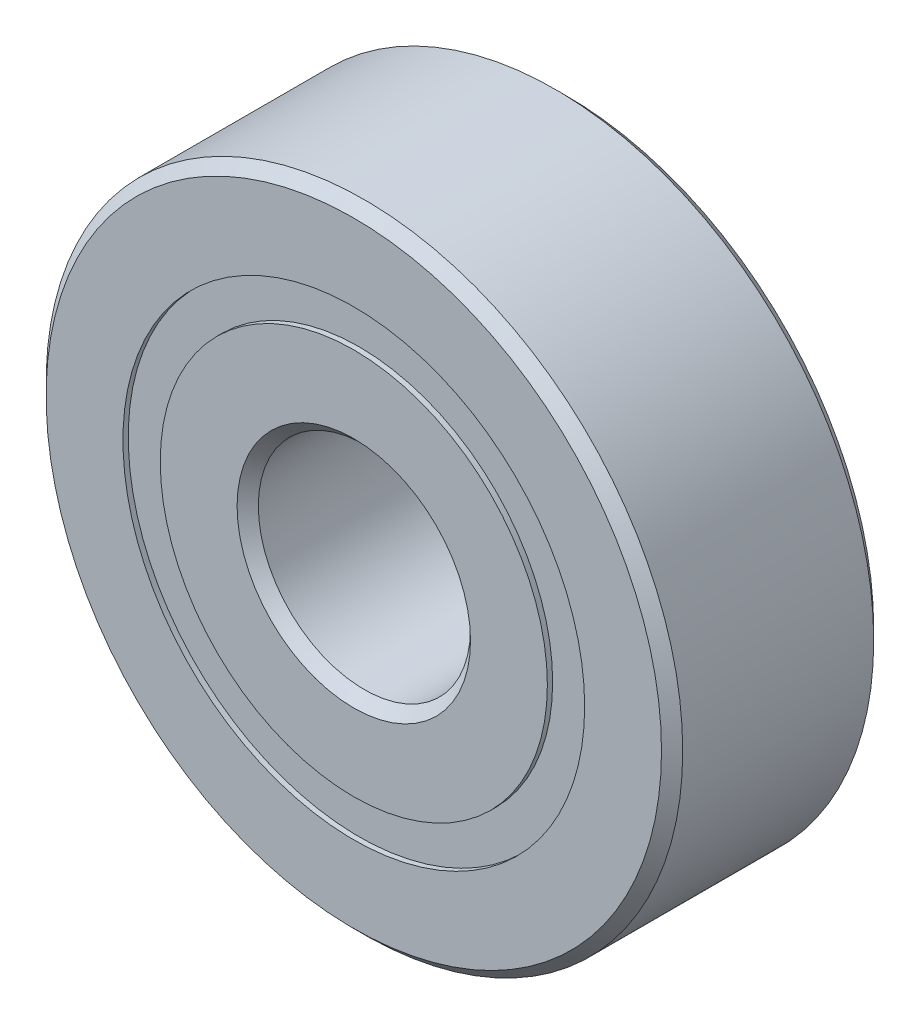
ISO-10303-21;
HEADER;
FILE_DESCRIPTION(('STEP AP214'),'2;1');
FILE_NAME('part.step','',(''),(''),'','','');
FILE_SCHEMA(('AUTOMOTIVE_DESIGN { 1 0 10303 214 1 1 1 1 }'));
ENDSEC;
DATA;
#1=APPLICATION_CONTEXT('core data for automotive mechanical design processes');
#2=APPLICATION_PROTOCOL_DEFINITION('international standard','automotive_design',2000,#1);
#3=PRODUCT_CONTEXT('',#1,'mechanical');
#4=PRODUCT('Part','Part','',(#3));
#5=PRODUCT_RELATED_PRODUCT_CATEGORY('part','',(#4));
#6=PRODUCT_DEFINITION_FORMATION('','',#4);
#7=PRODUCT_DEFINITION_CONTEXT('part definition',#1,'design');
#8=PRODUCT_DEFINITION('design','',#6,#7);
#9=PRODUCT_DEFINITION_SHAPE('','',#8);
#10=(LENGTH_UNIT() NAMED_UNIT(*) SI_UNIT(.MILLI.,.METRE.));
#11=(NAMED_UNIT(*) PLANE_ANGLE_UNIT() SI_UNIT($,.RADIAN.));
#12=(NAMED_UNIT(*) SI_UNIT($,.STERADIAN.) SOLID_ANGLE_UNIT());
#13=UNCERTAINTY_MEASURE_WITH_UNIT(LENGTH_MEASURE(1.E-05),#10,'distance_accuracy_value','');
#14=(GEOMETRIC_REPRESENTATION_CONTEXT(3) GLOBAL_UNCERTAINTY_ASSIGNED_CONTEXT((#13)) GLOBAL_UNIT_ASSIGNED_CONTEXT((#10,
#11,#12)) REPRESENTATION_CONTEXT('',''));
#15=CARTESIAN_POINT('',(0.,0.,0.));
#16=DIRECTION('',(0.,0.,1.));
#17=DIRECTION('',(1.,0.,0.));
#18=AXIS2_PLACEMENT_3D('',#15,#16,#17);
#19=CARTESIAN_POINT('',(0.,0.,1.8));
#20=DIRECTION('',(0.,0.,-0.999999999999999));
#21=DIRECTION('',(-1.,0.,0.));
#22=AXIS2_PLACEMENT_3D('',#19,#20,#21);
#23=CONICAL_SURFACE('',#22,6.,0.78539816339745);
#24=CARTESIAN_POINT('',(0.,0.,2.));
#25=DIRECTION('',(0.,0.,0.999999999999999));
#26=DIRECTION('',(1.,0.,0.));
#27=AXIS2_PLACEMENT_3D('',#24,#25,#26);
#28=CIRCLE('',#27,5.8);
#29=CARTESIAN_POINT('',(5.8,0.,2.));
#30=VERTEX_POINT('',#29);
#31=EDGE_CURVE('P0_E43',#30,#30,#28,.T.);
#32=ORIENTED_EDGE('',*,*,#31,.F.);
#33=EDGE_LOOP('',(#32));
#34=FACE_BOUND('',#33,.T.);
#35=CARTESIAN_POINT('',(0.,0.,1.8));
#36=DIRECTION('',(0.,0.,0.999999999999999));
#37=DIRECTION('',(1.,0.,0.));
#38=AXIS2_PLACEMENT_3D('',#35,#36,#37);
#39=CIRCLE('',#38,6.);
#40=CARTESIAN_POINT('',(6.,0.,1.8));
#41=VERTEX_POINT('',#40);
#42=EDGE_CURVE('P0_E10',#41,#41,#39,.T.);
#43=ORIENTED_EDGE('',*,*,#42,.T.);
#44=EDGE_LOOP('',(#43));
#45=FACE_BOUND('',#44,.T.);
#46=ADVANCED_FACE('P0_F15',(#34,#45),#23,.T.);
#47=CARTESIAN_POINT('',(0.,0.,2.));
#48=DIRECTION('',(0.,0.,0.999999999999999));
#49=DIRECTION('',(1.,0.,0.));
#50=AXIS2_PLACEMENT_3D('',#47,#48,#49);
#51=CYLINDRICAL_SURFACE('',#50,6.);
#52=ORIENTED_EDGE('',*,*,#42,.F.);
#53=EDGE_LOOP('',(#52));
#54=FACE_BOUND('',#53,.T.);
#55=CARTESIAN_POINT('',(0.,0.,-1.79999999999999));
#56=DIRECTION('',(0.,0.,0.999999999999999));
#57=DIRECTION('',(1.,0.,0.));
#58=AXIS2_PLACEMENT_3D('',#55,#56,#57);
#59=CIRCLE('',#58,6.);
#60=CARTESIAN_POINT('',(6.,0.,-1.79999999999999));
#61=VERTEX_POINT('',#60);
#62=EDGE_CURVE('P0_E21',#61,#61,#59,.T.);
#63=ORIENTED_EDGE('',*,*,#62,.T.);
#64=EDGE_LOOP('',(#63));
#65=FACE_BOUND('',#64,.T.);
#66=ADVANCED_FACE('P0_F50',(#54,#65),#51,.T.);
#67=CARTESIAN_POINT('',(0.,0.,-2.));
#68=DIRECTION('',(0.,0.,0.999999999999999));
#69=DIRECTION('',(1.,0.,0.));
#70=AXIS2_PLACEMENT_3D('',#67,#68,#69);
#71=CONICAL_SURFACE('',#70,5.8,0.78539816339745);
#72=ORIENTED_EDGE('',*,*,#62,.F.);
#73=EDGE_LOOP('',(#72));
#74=FACE_BOUND('',#73,.T.);
#75=CARTESIAN_POINT('',(0.,0.,-2.));
#76=DIRECTION('',(0.,0.,0.999999999999999));
#77=DIRECTION('',(1.,0.,0.));
#78=AXIS2_PLACEMENT_3D('',#75,#76,#77);
#79=CIRCLE('',#78,5.8);
#80=CARTESIAN_POINT('',(5.8,0.,-2.));
#81=VERTEX_POINT('',#80);
#82=EDGE_CURVE('P0_E25',#81,#81,#79,.T.);
#83=ORIENTED_EDGE('',*,*,#82,.T.);
#84=EDGE_LOOP('',(#83));
#85=FACE_BOUND('',#84,.T.);
#86=ADVANCED_FACE('P0_F55',(#74,#85),#71,.T.);
#87=CARTESIAN_POINT('',(0.,5.8,-2.));
#88=DIRECTION('',(0.,0.,0.999999999999999));
#89=DIRECTION('',(1.,0.,0.));
#90=AXIS2_PLACEMENT_3D('',#87,#88,#89);
#91=PLANE('',#90);
#92=ORIENTED_EDGE('',*,*,#82,.F.);
#93=EDGE_LOOP('',(#92));
#94=FACE_BOUND('',#93,.T.);
#95=CARTESIAN_POINT('',(0.,0.,-2.));
#96=DIRECTION('',(0.,0.,0.999999999999999));
#97=DIRECTION('',(1.,0.,0.));
#98=AXIS2_PLACEMENT_3D('',#95,#96,#97);
#99=CIRCLE('',#98,4.35164835164835);
#100=CARTESIAN_POINT('',(4.35164835164835,0.,-2.));
#101=VERTEX_POINT('',#100);
#102=EDGE_CURVE('P0_E29',#101,#101,#99,.T.);
#103=ORIENTED_EDGE('',*,*,#102,.T.);
#104=EDGE_LOOP('',(#103));
#105=FACE_BOUND('',#104,.T.);
#106=ADVANCED_FACE('P0_F60',(#94,#105),#91,.F.);
#107=CARTESIAN_POINT('',(0.,0.,2.));
#108=DIRECTION('',(0.,0.,0.999999999999999));
#109=DIRECTION('',(1.,0.,0.));
#110=AXIS2_PLACEMENT_3D('',#107,#108,#109);
#111=CYLINDRICAL_SURFACE('',#110,4.35164835164835);
#112=ORIENTED_EDGE('',*,*,#102,.F.);
#113=EDGE_LOOP('',(#112));
#114=FACE_BOUND('',#113,.T.);
#115=CARTESIAN_POINT('',(0.,0.,-0.888888888888884));
#116=DIRECTION('',(0.,0.,0.999999999999999));
#117=DIRECTION('',(1.,0.,0.));
#118=AXIS2_PLACEMENT_3D('',#115,#116,#117);
#119=CIRCLE('',#118,4.35164835164835);
#120=CARTESIAN_POINT('',(4.35164835164835,0.,-0.888888888888884));
#121=VERTEX_POINT('',#120);
#122=EDGE_CURVE('P0_E34',#121,#121,#119,.T.);
#123=ORIENTED_EDGE('',*,*,#122,.T.);
#124=EDGE_LOOP('',(#123));
#125=FACE_BOUND('',#124,.T.);
#126=ADVANCED_FACE('P0_F66',(#114,#125),#111,.F.);
#127=CARTESIAN_POINT('',(0.,0.,0.));
#128=DIRECTION('',(0.,0.,0.999999999999999));
#129=DIRECTION('',(1.,0.,0.));
#130=AXIS2_PLACEMENT_3D('',#127,#128,#129);
#131=TOROIDAL_SURFACE('',#130,4.,0.955918417024761);
#132=ORIENTED_EDGE('',*,*,#122,.F.);
#133=EDGE_LOOP('',(#132));
#134=FACE_BOUND('',#133,.T.);
#135=CARTESIAN_POINT('',(0.,0.,0.888888888888884));
#136=DIRECTION('',(0.,0.,0.999999999999999));
#137=DIRECTION('',(1.,0.,0.));
#138=AXIS2_PLACEMENT_3D('',#135,#136,#137);
#139=CIRCLE('',#138,4.35164835164835);
#140=CARTESIAN_POINT('',(4.35164835164835,0.,0.888888888888884));
#141=VERTEX_POINT('',#140);
#142=EDGE_CURVE('P0_E37',#141,#141,#139,.T.);
#143=ORIENTED_EDGE('',*,*,#142,.T.);
#144=EDGE_LOOP('',(#143));
#145=FACE_BOUND('',#144,.T.);
#146=ADVANCED_FACE('P0_F70',(#134,#145),#131,.F.);
#147=CARTESIAN_POINT('',(0.,0.,2.));
#148=DIRECTION('',(0.,0.,0.999999999999999));
#149=DIRECTION('',(1.,0.,0.));
#150=AXIS2_PLACEMENT_3D('',#147,#148,#149);
#151=CYLINDRICAL_SURFACE('',#150,4.35164835164835);
#152=ORIENTED_EDGE('',*,*,#142,.F.);
#153=EDGE_LOOP('',(#152));
#154=FACE_BOUND('',#153,.T.);
#155=CARTESIAN_POINT('',(0.,0.,2.));
#156=DIRECTION('',(0.,0.,0.999999999999999));
#157=DIRECTION('',(1.,0.,0.));
#158=AXIS2_PLACEMENT_3D('',#155,#156,#157);
#159=CIRCLE('',#158,4.35164835164835);
#160=CARTESIAN_POINT('',(4.35164835164835,0.,2.));
#161=VERTEX_POINT('',#160);
#162=EDGE_CURVE('P0_E40',#161,#161,#159,.T.);
#163=ORIENTED_EDGE('',*,*,#162,.T.);
#164=EDGE_LOOP('',(#163));
#165=FACE_BOUND('',#164,.T.);
#166=ADVANCED_FACE('P0_F74',(#154,#165),#151,.F.);
#167=CARTESIAN_POINT('',(0.,5.8,2.));
#168=DIRECTION('',(0.,0.,-0.999999999999999));
#169=DIRECTION('',(-1.,0.,0.));
#170=AXIS2_PLACEMENT_3D('',#167,#168,#169);
#171=PLANE('',#170);
#172=ORIENTED_EDGE('',*,*,#162,.F.);
#173=EDGE_LOOP('',(#172));
#174=FACE_BOUND('',#173,.T.);
#175=ORIENTED_EDGE('',*,*,#31,.T.);
#176=EDGE_LOOP('',(#175));
#177=FACE_BOUND('',#176,.T.);
#178=ADVANCED_FACE('P0_F47',(#174,#177),#171,.F.);
#179=CLOSED_SHELL('',(#46,#66,#86,#106,#126,#146,#166,#178));
#180=MANIFOLD_SOLID_BREP('P0_B1',#179);
#181=CARTESIAN_POINT('',(-2.00000000000003,-3.46410161513774,0.));
#182=DIRECTION('',(0.,0.,0.999999999999999));
#183=DIRECTION('',(-0.500000000000007,-0.866025403784435,0.));
#184=AXIS2_PLACEMENT_3D('',#181,#182,#183);
#185=SPHERICAL_SURFACE('',#184,0.955918417024761);
#186=CARTESIAN_POINT('',(-2.00000000000003,-3.46410161513774,0.955918417024761));
#187=VERTEX_POINT('',#186);
#188=VERTEX_LOOP('',#187);
#189=FACE_BOUND('',#188,.T.);
#190=ADVANCED_FACE('P1_F13',(#189),#185,.T.);
#191=CLOSED_SHELL('',(#190));
#192=MANIFOLD_SOLID_BREP('P1_B1',#191);
#193=CARTESIAN_POINT('',(-3.46410161513777,-1.99999999999997,0.));
#194=DIRECTION('',(0.,0.,0.999999999999999));
#195=DIRECTION('',(-0.866025403784444,-0.499999999999992,0.));
#196=AXIS2_PLACEMENT_3D('',#193,#194,#195);
#197=SPHERICAL_SURFACE('',#196,0.955918417024761);
#198=CARTESIAN_POINT('',(-3.46410161513777,-1.99999999999997,0.955918417024761));
#199=VERTEX_POINT('',#198);
#200=VERTEX_LOOP('',#199);
#201=FACE_BOUND('',#200,.T.);
#202=ADVANCED_FACE('P2_F13',(#201),#197,.T.);
#203=CLOSED_SHELL('',(#202));
#204=MANIFOLD_SOLID_BREP('P2_B1',#203);
#205=CARTESIAN_POINT('',(-4.,0.,0.));
#206=DIRECTION('',(0.,0.,0.999999999999999));
#207=DIRECTION('',(-1.,0.,0.));
#208=AXIS2_PLACEMENT_3D('',#205,#206,#207);
#209=SPHERICAL_SURFACE('',#208,0.955918417024761);
#210=CARTESIAN_POINT('',(-4.,0.,0.955918417024761));
#211=VERTEX_POINT('',#210);
#212=VERTEX_LOOP('',#211);
#213=FACE_BOUND('',#212,.T.);
#214=ADVANCED_FACE('P3_F13',(#213),#209,.T.);
#215=CLOSED_SHELL('',(#214));
#216=MANIFOLD_SOLID_BREP('P3_B1',#215);
#217=CARTESIAN_POINT('',(-3.46410161513773,2.00000000000004,0.));
#218=DIRECTION('',(0.,0.,0.999999999999999));
#219=DIRECTION('',(-0.866025403784433,0.50000000000001,0.));
#220=AXIS2_PLACEMENT_3D('',#217,#218,#219);
#221=SPHERICAL_SURFACE('',#220,0.955918417024761);
#222=CARTESIAN_POINT('',(-3.46410161513773,2.00000000000004,0.955918417024761));
#223=VERTEX_POINT('',#222);
#224=VERTEX_LOOP('',#223);
#225=FACE_BOUND('',#224,.T.);
#226=ADVANCED_FACE('P4_F13',(#225),#221,.T.);
#227=CLOSED_SHELL('',(#226));
#228=MANIFOLD_SOLID_BREP('P4_B1',#227);
#229=CARTESIAN_POINT('',(-1.99999999999996,3.46410161513778,0.));
#230=DIRECTION('',(0.,0.,0.999999999999999));
#231=DIRECTION('',(-0.499999999999989,0.866025403784445,0.));
#232=AXIS2_PLACEMENT_3D('',#229,#230,#231);
#233=SPHERICAL_SURFACE('',#232,0.955918417024761);
#234=CARTESIAN_POINT('',(-1.99999999999996,3.46410161513778,0.955918417024761));
#235=VERTEX_POINT('',#234);
#236=VERTEX_LOOP('',#235);
#237=FACE_BOUND('',#236,.T.);
#238=ADVANCED_FACE('P5_F13',(#237),#233,.T.);
#239=CLOSED_SHELL('',(#238));
#240=MANIFOLD_SOLID_BREP('P5_B1',#239);
#241=CARTESIAN_POINT('',(0.,4.35164835164835,1.9));
#242=DIRECTION('',(0.,0.,-0.999999999999999));
#243=DIRECTION('',(-1.,0.,0.));
#244=AXIS2_PLACEMENT_3D('',#241,#242,#243);
#245=PLANE('',#244);
#246=CARTESIAN_POINT('',(0.,0.,1.9));
#247=DIRECTION('',(0.,0.,0.999999999999999));
#248=DIRECTION('',(1.,0.,0.));
#249=AXIS2_PLACEMENT_3D('',#246,#247,#248);
#250=CIRCLE('',#249,3.64835164835165);
#251=CARTESIAN_POINT('',(3.64835164835165,0.,1.9));
#252=VERTEX_POINT('',#251);
#253=EDGE_CURVE('P6_E10',#252,#252,#250,.T.);
#254=ORIENTED_EDGE('',*,*,#253,.F.);
#255=EDGE_LOOP('',(#254));
#256=FACE_BOUND('',#255,.T.);
#257=CARTESIAN_POINT('',(0.,0.,1.9));
#258=DIRECTION('',(0.,0.,0.999999999999999));
#259=DIRECTION('',(1.,0.,0.));
#260=AXIS2_PLACEMENT_3D('',#257,#258,#259);
#261=CIRCLE('',#260,4.35164835164835);
#262=CARTESIAN_POINT('',(4.35164835164835,0.,1.9));
#263=VERTEX_POINT('',#262);
#264=EDGE_CURVE('P6_E29',#263,#263,#261,.T.);
#265=ORIENTED_EDGE('',*,*,#264,.T.);
#266=EDGE_LOOP('',(#265));
#267=FACE_BOUND('',#266,.T.);
#268=ADVANCED_FACE('P6_F15',(#256,#267),#245,.F.);
#269=CARTESIAN_POINT('',(0.,0.,2.));
#270=DIRECTION('',(0.,0.,0.999999999999999));
#271=DIRECTION('',(1.,0.,0.));
#272=AXIS2_PLACEMENT_3D('',#269,#270,#271);
#273=CYLINDRICAL_SURFACE('',#272,3.64835164835165);
#274=CARTESIAN_POINT('',(0.,0.,0.955918417024762));
#275=DIRECTION('',(0.,0.,0.999999999999999));
#276=DIRECTION('',(1.,0.,0.));
#277=AXIS2_PLACEMENT_3D('',#274,#275,#276);
#278=CIRCLE('',#277,3.64835164835165);
#279=CARTESIAN_POINT('',(3.64835164835165,0.,0.955918417024762));
#280=VERTEX_POINT('',#279);
#281=EDGE_CURVE('P6_E21',#280,#280,#278,.T.);
#282=ORIENTED_EDGE('',*,*,#281,.F.);
#283=EDGE_LOOP('',(#282));
#284=FACE_BOUND('',#283,.T.);
#285=ORIENTED_EDGE('',*,*,#253,.T.);
#286=EDGE_LOOP('',(#285));
#287=FACE_BOUND('',#286,.T.);
#288=ADVANCED_FACE('P6_F44',(#284,#287),#273,.F.);
#289=CARTESIAN_POINT('',(0.,4.35164835164835,0.955918417024762));
#290=DIRECTION('',(0.,0.,0.999999999999999));
#291=DIRECTION('',(1.,0.,0.));
#292=AXIS2_PLACEMENT_3D('',#289,#290,#291);
#293=PLANE('',#292);
#294=CARTESIAN_POINT('',(0.,0.,0.955918417024762));
#295=DIRECTION('',(0.,0.,0.999999999999999));
#296=DIRECTION('',(1.,0.,0.));
#297=AXIS2_PLACEMENT_3D('',#294,#295,#296);
#298=CIRCLE('',#297,4.35164835164835);
#299=CARTESIAN_POINT('',(4.35164835164835,0.,0.955918417024762));
#300=VERTEX_POINT('',#299);
#301=EDGE_CURVE('P6_E25',#300,#300,#298,.T.);
#302=ORIENTED_EDGE('',*,*,#301,.F.);
#303=EDGE_LOOP('',(#302));
#304=FACE_BOUND('',#303,.T.);
#305=ORIENTED_EDGE('',*,*,#281,.T.);
#306=EDGE_LOOP('',(#305));
#307=FACE_BOUND('',#306,.T.);
#308=ADVANCED_FACE('P6_F39',(#304,#307),#293,.F.);
#309=CARTESIAN_POINT('',(0.,0.,2.));
#310=DIRECTION('',(0.,0.,0.999999999999999));
#311=DIRECTION('',(1.,0.,0.));
#312=AXIS2_PLACEMENT_3D('',#309,#310,#311);
#313=CYLINDRICAL_SURFACE('',#312,4.35164835164835);
#314=ORIENTED_EDGE('',*,*,#264,.F.);
#315=EDGE_LOOP('',(#314));
#316=FACE_BOUND('',#315,.T.);
#317=ORIENTED_EDGE('',*,*,#301,.T.);
#318=EDGE_LOOP('',(#317));
#319=FACE_BOUND('',#318,.T.);
#320=ADVANCED_FACE('P6_F36',(#316,#319),#313,.T.);
#321=CLOSED_SHELL('',(#268,#288,#308,#320));
#322=MANIFOLD_SOLID_BREP('P6_B1',#321);
#323=CARTESIAN_POINT('',(0.,4.35164835164835,-1.9));
#324=DIRECTION('',(0.,0.,0.999999999999999));
#325=DIRECTION('',(1.,0.,0.));
#326=AXIS2_PLACEMENT_3D('',#323,#324,#325);
#327=PLANE('',#326);
#328=CARTESIAN_POINT('',(0.,0.,-1.9));
#329=DIRECTION('',(0.,0.,0.999999999999999));
#330=DIRECTION('',(1.,0.,0.));
#331=AXIS2_PLACEMENT_3D('',#328,#329,#330);
#332=CIRCLE('',#331,4.35164835164835);
#333=CARTESIAN_POINT('',(4.35164835164835,0.,-1.9));
#334=VERTEX_POINT('',#333);
#335=EDGE_CURVE('P7_E29',#334,#334,#332,.T.);
#336=ORIENTED_EDGE('',*,*,#335,.F.);
#337=EDGE_LOOP('',(#336));
#338=FACE_BOUND('',#337,.T.);
#339=CARTESIAN_POINT('',(0.,0.,-1.9));
#340=DIRECTION('',(0.,0.,0.999999999999999));
#341=DIRECTION('',(1.,0.,0.));
#342=AXIS2_PLACEMENT_3D('',#339,#340,#341);
#343=CIRCLE('',#342,3.64835164835165);
#344=CARTESIAN_POINT('',(3.64835164835165,0.,-1.9));
#345=VERTEX_POINT('',#344);
#346=EDGE_CURVE('P7_E10',#345,#345,#343,.T.);
#347=ORIENTED_EDGE('',*,*,#346,.T.);
#348=EDGE_LOOP('',(#347));
#349=FACE_BOUND('',#348,.T.);
#350=ADVANCED_FACE('P7_F15',(#338,#349),#327,.F.);
#351=CARTESIAN_POINT('',(0.,0.,2.));
#352=DIRECTION('',(0.,0.,0.999999999999999));
#353=DIRECTION('',(1.,0.,0.));
#354=AXIS2_PLACEMENT_3D('',#351,#352,#353);
#355=CYLINDRICAL_SURFACE('',#354,3.64835164835165);
#356=ORIENTED_EDGE('',*,*,#346,.F.);
#357=EDGE_LOOP('',(#356));
#358=FACE_BOUND('',#357,.T.);
#359=CARTESIAN_POINT('',(0.,0.,-0.95591841702476));
#360=DIRECTION('',(0.,0.,0.999999999999999));
#361=DIRECTION('',(1.,0.,0.));
#362=AXIS2_PLACEMENT_3D('',#359,#360,#361);
#363=CIRCLE('',#362,3.64835164835165);
#364=CARTESIAN_POINT('',(3.64835164835165,0.,-0.95591841702476));
#365=VERTEX_POINT('',#364);
#366=EDGE_CURVE('P7_E21',#365,#365,#363,.T.);
#367=ORIENTED_EDGE('',*,*,#366,.T.);
#368=EDGE_LOOP('',(#367));
#369=FACE_BOUND('',#368,.T.);
#370=ADVANCED_FACE('P7_F38',(#358,#369),#355,.F.);
#371=CARTESIAN_POINT('',(0.,4.35164835164835,-0.95591841702476));
#372=DIRECTION('',(0.,0.,-0.999999999999999));
#373=DIRECTION('',(-1.,0.,0.));
#374=AXIS2_PLACEMENT_3D('',#371,#372,#373);
#375=PLANE('',#374);
#376=ORIENTED_EDGE('',*,*,#366,.F.);
#377=EDGE_LOOP('',(#376));
#378=FACE_BOUND('',#377,.T.);
#379=CARTESIAN_POINT('',(0.,0.,-0.95591841702476));
#380=DIRECTION('',(0.,0.,0.999999999999999));
#381=DIRECTION('',(1.,0.,0.));
#382=AXIS2_PLACEMENT_3D('',#379,#380,#381);
#383=CIRCLE('',#382,4.35164835164835);
#384=CARTESIAN_POINT('',(4.35164835164835,0.,-0.95591841702476));
#385=VERTEX_POINT('',#384);
#386=EDGE_CURVE('P7_E25',#385,#385,#383,.T.);
#387=ORIENTED_EDGE('',*,*,#386,.T.);
#388=EDGE_LOOP('',(#387));
#389=FACE_BOUND('',#388,.T.);
#390=ADVANCED_FACE('P7_F43',(#378,#389),#375,.F.);
#391=CARTESIAN_POINT('',(0.,0.,2.));
#392=DIRECTION('',(0.,0.,0.999999999999999));
#393=DIRECTION('',(1.,0.,0.));
#394=AXIS2_PLACEMENT_3D('',#391,#392,#393);
#395=CYLINDRICAL_SURFACE('',#394,4.35164835164835);
#396=ORIENTED_EDGE('',*,*,#386,.F.);
#397=EDGE_LOOP('',(#396));
#398=FACE_BOUND('',#397,.T.);
#399=ORIENTED_EDGE('',*,*,#335,.T.);
#400=EDGE_LOOP('',(#399));
#401=FACE_BOUND('',#400,.T.);
#402=ADVANCED_FACE('P7_F35',(#398,#401),#395,.T.);
#403=CLOSED_SHELL('',(#350,#370,#390,#402));
#404=MANIFOLD_SOLID_BREP('P7_B1',#403);
#405=CARTESIAN_POINT('',(0.,3.64835164835165,2.));
#406=DIRECTION('',(0.,0.,-0.999999999999999));
#407=DIRECTION('',(-1.,0.,0.));
#408=AXIS2_PLACEMENT_3D('',#405,#406,#407);
#409=PLANE('',#408);
#410=CARTESIAN_POINT('',(0.,0.,2.));
#411=DIRECTION('',(0.,0.,0.999999999999999));
#412=DIRECTION('',(1.,0.,0.));
#413=AXIS2_PLACEMENT_3D('',#410,#411,#412);
#414=CIRCLE('',#413,2.2);
#415=CARTESIAN_POINT('',(2.2,0.,2.));
#416=VERTEX_POINT('',#415);
#417=EDGE_CURVE('P8_E43',#416,#416,#414,.T.);
#418=ORIENTED_EDGE('',*,*,#417,.F.);
#419=EDGE_LOOP('',(#418));
#420=FACE_BOUND('',#419,.T.);
#421=CARTESIAN_POINT('',(0.,0.,2.));
#422=DIRECTION('',(0.,0.,0.999999999999999));
#423=DIRECTION('',(1.,0.,0.));
#424=AXIS2_PLACEMENT_3D('',#421,#422,#423);
#425=CIRCLE('',#424,3.64835164835165);
#426=CARTESIAN_POINT('',(3.64835164835165,0.,2.));
#427=VERTEX_POINT('',#426);
#428=EDGE_CURVE('P8_E10',#427,#427,#425,.T.);
#429=ORIENTED_EDGE('',*,*,#428,.T.);
#430=EDGE_LOOP('',(#429));
#431=FACE_BOUND('',#430,.T.);
#432=ADVANCED_FACE('P8_F15',(#420,#431),#409,.F.);
#433=CARTESIAN_POINT('',(0.,0.,2.));
#434=DIRECTION('',(0.,0.,0.999999999999999));
#435=DIRECTION('',(1.,0.,0.));
#436=AXIS2_PLACEMENT_3D('',#433,#434,#435);
#437=CYLINDRICAL_SURFACE('',#436,3.64835164835165);
#438=ORIENTED_EDGE('',*,*,#428,.F.);
#439=EDGE_LOOP('',(#438));
#440=FACE_BOUND('',#439,.T.);
#441=CARTESIAN_POINT('',(0.,0.,0.888888888888884));
#442=DIRECTION('',(0.,0.,0.999999999999999));
#443=DIRECTION('',(1.,0.,0.));
#444=AXIS2_PLACEMENT_3D('',#441,#442,#443);
#445=CIRCLE('',#444,3.64835164835165);
#446=CARTESIAN_POINT('',(3.64835164835165,0.,0.888888888888884));
#447=VERTEX_POINT('',#446);
#448=EDGE_CURVE('P8_E21',#447,#447,#445,.T.);
#449=ORIENTED_EDGE('',*,*,#448,.T.);
#450=EDGE_LOOP('',(#449));
#451=FACE_BOUND('',#450,.T.);
#452=ADVANCED_FACE('P8_F50',(#440,#451),#437,.T.);
#453=CARTESIAN_POINT('',(0.,0.,0.));
#454=DIRECTION('',(0.,0.,0.999999999999999));
#455=DIRECTION('',(1.,0.,0.));
#456=AXIS2_PLACEMENT_3D('',#453,#454,#455);
#457=TOROIDAL_SURFACE('',#456,4.,0.95591841702476);
#458=ORIENTED_EDGE('',*,*,#448,.F.);
#459=EDGE_LOOP('',(#458));
#460=FACE_BOUND('',#459,.T.);
#461=CARTESIAN_POINT('',(0.,0.,-0.888888888888884));
#462=DIRECTION('',(0.,0.,0.999999999999999));
#463=DIRECTION('',(1.,0.,0.));
#464=AXIS2_PLACEMENT_3D('',#461,#462,#463);
#465=CIRCLE('',#464,3.64835164835165);
#466=CARTESIAN_POINT('',(3.64835164835165,0.,-0.888888888888884));
#467=VERTEX_POINT('',#466);
#468=EDGE_CURVE('P8_E25',#467,#467,#465,.T.);
#469=ORIENTED_EDGE('',*,*,#468,.T.);
#470=EDGE_LOOP('',(#469));
#471=FACE_BOUND('',#470,.T.);
#472=ADVANCED_FACE('P8_F55',(#460,#471),#457,.F.);
#473=CARTESIAN_POINT('',(0.,0.,2.));
#474=DIRECTION('',(0.,0.,0.999999999999999));
#475=DIRECTION('',(1.,0.,0.));
#476=AXIS2_PLACEMENT_3D('',#473,#474,#475);
#477=CYLINDRICAL_SURFACE('',#476,3.64835164835165);
#478=ORIENTED_EDGE('',*,*,#468,.F.);
#479=EDGE_LOOP('',(#478));
#480=FACE_BOUND('',#479,.T.);
#481=CARTESIAN_POINT('',(0.,0.,-2.));
#482=DIRECTION('',(0.,0.,0.999999999999999));
#483=DIRECTION('',(1.,0.,0.));
#484=AXIS2_PLACEMENT_3D('',#481,#482,#483);
#485=CIRCLE('',#484,3.64835164835165);
#486=CARTESIAN_POINT('',(3.64835164835165,0.,-2.));
#487=VERTEX_POINT('',#486);
#488=EDGE_CURVE('P8_E29',#487,#487,#485,.T.);
#489=ORIENTED_EDGE('',*,*,#488,.T.);
#490=EDGE_LOOP('',(#489));
#491=FACE_BOUND('',#490,.T.);
#492=ADVANCED_FACE('P8_F60',(#480,#491),#477,.T.);
#493=CARTESIAN_POINT('',(0.,2.2,-2.));
#494=DIRECTION('',(0.,0.,0.999999999999999));
#495=DIRECTION('',(1.,0.,0.));
#496=AXIS2_PLACEMENT_3D('',#493,#494,#495);
#497=PLANE('',#496);
#498=ORIENTED_EDGE('',*,*,#488,.F.);
#499=EDGE_LOOP('',(#498));
#500=FACE_BOUND('',#499,.T.);
#501=CARTESIAN_POINT('',(0.,0.,-2.));
#502=DIRECTION('',(0.,0.,0.999999999999999));
#503=DIRECTION('',(1.,0.,0.));
#504=AXIS2_PLACEMENT_3D('',#501,#502,#503);
#505=CIRCLE('',#504,2.2);
#506=CARTESIAN_POINT('',(2.2,0.,-2.));
#507=VERTEX_POINT('',#506);
#508=EDGE_CURVE('P8_E34',#507,#507,#505,.T.);
#509=ORIENTED_EDGE('',*,*,#508,.T.);
#510=EDGE_LOOP('',(#509));
#511=FACE_BOUND('',#510,.T.);
#512=ADVANCED_FACE('P8_F66',(#500,#511),#497,.F.);
#513=CARTESIAN_POINT('',(0.,0.,-1.8));
#514=DIRECTION('',(0.,0.,-0.999999999999999));
#515=DIRECTION('',(-1.,0.,0.));
#516=AXIS2_PLACEMENT_3D('',#513,#514,#515);
#517=CONICAL_SURFACE('',#516,2.,0.785398163397454);
#518=ORIENTED_EDGE('',*,*,#508,.F.);
#519=EDGE_LOOP('',(#518));
#520=FACE_BOUND('',#519,.T.);
#521=CARTESIAN_POINT('',(0.,0.,-1.8));
#522=DIRECTION('',(0.,0.,0.999999999999999));
#523=DIRECTION('',(1.,0.,0.));
#524=AXIS2_PLACEMENT_3D('',#521,#522,#523);
#525=CIRCLE('',#524,2.);
#526=CARTESIAN_POINT('',(2.,0.,-1.8));
#527=VERTEX_POINT('',#526);
#528=EDGE_CURVE('P8_E37',#527,#527,#525,.T.);
#529=ORIENTED_EDGE('',*,*,#528,.T.);
#530=EDGE_LOOP('',(#529));
#531=FACE_BOUND('',#530,.T.);
#532=ADVANCED_FACE('P8_F70',(#520,#531),#517,.F.);
#533=CARTESIAN_POINT('',(0.,0.,2.));
#534=DIRECTION('',(0.,0.,0.999999999999999));
#535=DIRECTION('',(1.,0.,0.));
#536=AXIS2_PLACEMENT_3D('',#533,#534,#535);
#537=CYLINDRICAL_SURFACE('',#536,2.);
#538=ORIENTED_EDGE('',*,*,#528,.F.);
#539=EDGE_LOOP('',(#538));
#540=FACE_BOUND('',#539,.T.);
#541=CARTESIAN_POINT('',(0.,0.,1.8));
#542=DIRECTION('',(0.,0.,0.999999999999999));
#543=DIRECTION('',(1.,0.,0.));
#544=AXIS2_PLACEMENT_3D('',#541,#542,#543);
#545=CIRCLE('',#544,2.);
#546=CARTESIAN_POINT('',(2.,0.,1.8));
#547=VERTEX_POINT('',#546);
#548=EDGE_CURVE('P8_E40',#547,#547,#545,.T.);
#549=ORIENTED_EDGE('',*,*,#548,.T.);
#550=EDGE_LOOP('',(#549));
#551=FACE_BOUND('',#550,.T.);
#552=ADVANCED_FACE('P8_F74',(#540,#551),#537,.F.);
#553=CARTESIAN_POINT('',(0.,0.,2.));
#554=DIRECTION('',(0.,0.,0.999999999999999));
#555=DIRECTION('',(1.,0.,0.));
#556=AXIS2_PLACEMENT_3D('',#553,#554,#555);
#557=CONICAL_SURFACE('',#556,2.2,0.785398163397442);
#558=ORIENTED_EDGE('',*,*,#548,.F.);
#559=EDGE_LOOP('',(#558));
#560=FACE_BOUND('',#559,.T.);
#561=ORIENTED_EDGE('',*,*,#417,.T.);
#562=EDGE_LOOP('',(#561));
#563=FACE_BOUND('',#562,.T.);
#564=ADVANCED_FACE('P8_F47',(#560,#563),#557,.F.);
#565=CLOSED_SHELL('',(#432,#452,#472,#492,#512,#532,#552,#564));
#566=MANIFOLD_SOLID_BREP('P8_B1',#565);
#567=CARTESIAN_POINT('',(0.,4.,0.));
#568=DIRECTION('',(0.,0.,0.999999999999999));
#569=DIRECTION('',(0.,1.,0.));
#570=AXIS2_PLACEMENT_3D('',#567,#568,#569);
#571=SPHERICAL_SURFACE('',#570,0.955918417024761);
#572=CARTESIAN_POINT('',(0.,4.,0.955918417024761));
#573=VERTEX_POINT('',#572);
#574=VERTEX_LOOP('',#573);
#575=FACE_BOUND('',#574,.T.);
#576=ADVANCED_FACE('P9_F13',(#575),#571,.T.);
#577=CLOSED_SHELL('',(#576));
#578=MANIFOLD_SOLID_BREP('P9_B1',#577);
#579=CARTESIAN_POINT('',(2.,3.46410161513775,0.));
#580=DIRECTION('',(0.,0.,0.999999999999999));
#581=DIRECTION('',(0.500000000000001,0.866025403784439,0.));
#582=AXIS2_PLACEMENT_3D('',#579,#580,#581);
#583=SPHERICAL_SURFACE('',#582,0.955918417024761);
#584=CARTESIAN_POINT('',(2.,3.46410161513775,0.955918417024761));
#585=VERTEX_POINT('',#584);
#586=VERTEX_LOOP('',#585);
#587=FACE_BOUND('',#586,.T.);
#588=ADVANCED_FACE('P10_F13',(#587),#583,.T.);
#589=CLOSED_SHELL('',(#588));
#590=MANIFOLD_SOLID_BREP('P10_B1',#589);
#591=CARTESIAN_POINT('',(3.46410161513776,1.99999999999999,0.));
#592=DIRECTION('',(0.,0.,0.999999999999999));
#593=DIRECTION('',(0.86602540378444,0.499999999999998,0.));
#594=AXIS2_PLACEMENT_3D('',#591,#592,#593);
#595=SPHERICAL_SURFACE('',#594,0.955918417024761);
#596=CARTESIAN_POINT('',(3.46410161513776,1.99999999999999,0.955918417024761));
#597=VERTEX_POINT('',#596);
#598=VERTEX_LOOP('',#597);
#599=FACE_BOUND('',#598,.T.);
#600=ADVANCED_FACE('P11_F13',(#599),#595,.T.);
#601=CLOSED_SHELL('',(#600));
#602=MANIFOLD_SOLID_BREP('P11_B1',#601);
#603=CARTESIAN_POINT('',(4.,0.,0.));
#604=DIRECTION('',(0.,0.,0.999999999999999));
#605=DIRECTION('',(1.,0.,0.));
#606=AXIS2_PLACEMENT_3D('',#603,#604,#605);
#607=SPHERICAL_SURFACE('',#606,0.955918417024761);
#608=CARTESIAN_POINT('',(4.,0.,0.955918417024761));
#609=VERTEX_POINT('',#608);
#610=VERTEX_LOOP('',#609);
#611=FACE_BOUND('',#610,.T.);
#612=ADVANCED_FACE('P12_F13',(#611),#607,.T.);
#613=CLOSED_SHELL('',(#612));
#614=MANIFOLD_SOLID_BREP('P12_B1',#613);
#615=CARTESIAN_POINT('',(3.46410161513775,-2.00000000000002,0.));
#616=DIRECTION('',(0.,0.,0.999999999999999));
#617=DIRECTION('',(0.866025403784437,-0.500000000000004,0.));
#618=AXIS2_PLACEMENT_3D('',#615,#616,#617);
#619=SPHERICAL_SURFACE('',#618,0.955918417024761);
#620=CARTESIAN_POINT('',(3.46410161513775,-2.00000000000002,0.955918417024761));
#621=VERTEX_POINT('',#620);
#622=VERTEX_LOOP('',#621);
#623=FACE_BOUND('',#622,.T.);
#624=ADVANCED_FACE('P13_F13',(#623),#619,.T.);
#625=CLOSED_SHELL('',(#624));
#626=MANIFOLD_SOLID_BREP('P13_B1',#625);
#627=CARTESIAN_POINT('',(1.99999999999998,-3.46410161513777,0.));
#628=DIRECTION('',(0.,0.,0.999999999999999));
#629=DIRECTION('',(0.499999999999995,-0.866025403784442,0.));
#630=AXIS2_PLACEMENT_3D('',#627,#628,#629);
#631=SPHERICAL_SURFACE('',#630,0.955918417024761);
#632=CARTESIAN_POINT('',(1.99999999999998,-3.46410161513777,0.955918417024761));
#633=VERTEX_POINT('',#632);
#634=VERTEX_LOOP('',#633);
#635=FACE_BOUND('',#634,.T.);
#636=ADVANCED_FACE('P14_F13',(#635),#631,.T.);
#637=CLOSED_SHELL('',(#636));
#638=MANIFOLD_SOLID_BREP('P14_B1',#637);
#639=CARTESIAN_POINT('',(0.,-4.,0.));
#640=DIRECTION('',(0.,0.,0.999999999999999));
#641=DIRECTION('',(0.,-1.,0.));
#642=AXIS2_PLACEMENT_3D('',#639,#640,#641);
#643=SPHERICAL_SURFACE('',#642,0.955918417024761);
#644=CARTESIAN_POINT('',(0.,-4.,0.955918417024761));
#645=VERTEX_POINT('',#644);
#646=VERTEX_LOOP('',#645);
#647=FACE_BOUND('',#646,.T.);
#648=ADVANCED_FACE('P15_F13',(#647),#643,.T.);
#649=CLOSED_SHELL('',(#648));
#650=MANIFOLD_SOLID_BREP('P15_B1',#649);
#651=ADVANCED_BREP_SHAPE_REPRESENTATION('',(#18,#180,#192,#204,#216,#228,#240,#322,#404,#566,
#578,#590,#602,#614,#626,#638,#650),#14);
#652=SHAPE_DEFINITION_REPRESENTATION(#9,#651);
ENDSEC;
END-ISO-10303-21;
